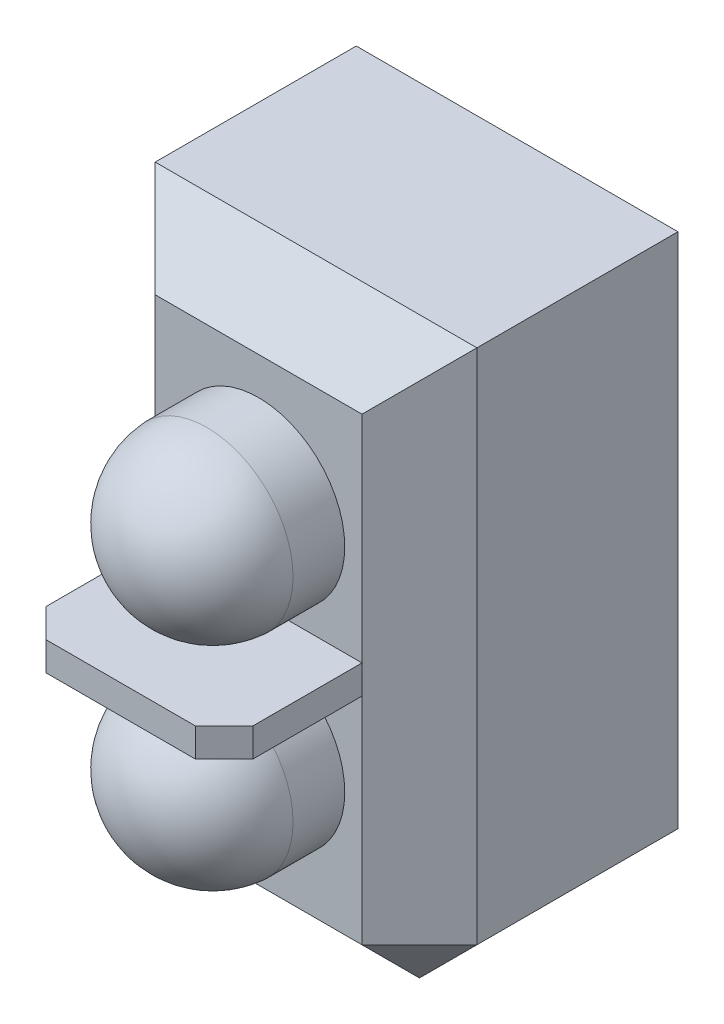
ISO-10303-21;
HEADER;
FILE_DESCRIPTION(('STEP AP214'),'2;1');
FILE_NAME('part.step','',(''),(''),'','','');
FILE_SCHEMA(('AUTOMOTIVE_DESIGN { 1 0 10303 214 1 1 1 1 }'));
ENDSEC;
DATA;
#1=APPLICATION_CONTEXT('core data for automotive mechanical design processes');
#2=APPLICATION_PROTOCOL_DEFINITION('international standard','automotive_design',2000,#1);
#3=PRODUCT_CONTEXT('',#1,'mechanical');
#4=PRODUCT('Part','Part','',(#3));
#5=PRODUCT_RELATED_PRODUCT_CATEGORY('part','',(#4));
#6=PRODUCT_DEFINITION_FORMATION('','',#4);
#7=PRODUCT_DEFINITION_CONTEXT('part definition',#1,'design');
#8=PRODUCT_DEFINITION('design','',#6,#7);
#9=PRODUCT_DEFINITION_SHAPE('','',#8);
#10=(LENGTH_UNIT() NAMED_UNIT(*) SI_UNIT(.MILLI.,.METRE.));
#11=(NAMED_UNIT(*) PLANE_ANGLE_UNIT() SI_UNIT($,.RADIAN.));
#12=(NAMED_UNIT(*) SI_UNIT($,.STERADIAN.) SOLID_ANGLE_UNIT());
#13=UNCERTAINTY_MEASURE_WITH_UNIT(LENGTH_MEASURE(1.E-05),#10,'distance_accuracy_value','');
#14=(GEOMETRIC_REPRESENTATION_CONTEXT(3) GLOBAL_UNCERTAINTY_ASSIGNED_CONTEXT((#13)) GLOBAL_UNIT_ASSIGNED_CONTEXT((#10,
#11,#12)) REPRESENTATION_CONTEXT('',''));
#15=CARTESIAN_POINT('',(0.,0.,0.));
#16=DIRECTION('',(0.,0.,1.));
#17=DIRECTION('',(1.,0.,0.));
#18=AXIS2_PLACEMENT_3D('',#15,#16,#17);
#19=CARTESIAN_POINT('',(2.8,-5.,4.5));
#20=DIRECTION('',(0.,0.,1.));
#21=DIRECTION('',(1.,0.,0.));
#22=AXIS2_PLACEMENT_3D('',#19,#20,#21);
#23=PLANE('',#22);
#24=CARTESIAN_POINT('',(0.,1.85,4.5));
#25=DIRECTION('',(0.,0.,1.));
#26=DIRECTION('',(1.,0.,0.));
#27=AXIS2_PLACEMENT_3D('',#24,#25,#26);
#28=CIRCLE('',#27,1.5);
#29=CARTESIAN_POINT('',(1.5,1.85,4.5));
#30=VERTEX_POINT('',#29);
#31=EDGE_CURVE('E185',#30,#30,#28,.T.);
#32=ORIENTED_EDGE('',*,*,#31,.F.);
#33=EDGE_LOOP('',(#32));
#34=FACE_BOUND('',#33,.T.);
#35=DIRECTION('',(0.,-1.,0.));
#36=VECTOR('',#35,1.);
#37=CARTESIAN_POINT('',(-1.79999999999999,-5.,4.5));
#38=LINE('',#37,#36);
#39=CARTESIAN_POINT('',(-1.8,4.,4.5));
#40=VERTEX_POINT('',#39);
#41=CARTESIAN_POINT('',(-1.8,0.25,4.5));
#42=VERTEX_POINT('',#41);
#43=EDGE_CURVE('E161',#40,#42,#38,.T.);
#44=ORIENTED_EDGE('',*,*,#43,.T.);
#45=DIRECTION('',(-1.,0.,0.));
#46=VECTOR('',#45,1.);
#47=CARTESIAN_POINT('',(-1.8,0.25,4.5));
#48=LINE('',#47,#46);
#49=CARTESIAN_POINT('',(1.8,0.25,4.5));
#50=VERTEX_POINT('',#49);
#51=EDGE_CURVE('E136',#50,#42,#48,.T.);
#52=ORIENTED_EDGE('',*,*,#51,.F.);
#53=DIRECTION('',(0.,1.,0.));
#54=VECTOR('',#53,1.);
#55=CARTESIAN_POINT('',(1.8,5.,4.5));
#56=LINE('',#55,#54);
#57=CARTESIAN_POINT('',(1.8,4.,4.5));
#58=VERTEX_POINT('',#57);
#59=EDGE_CURVE('E146',#50,#58,#56,.T.);
#60=ORIENTED_EDGE('',*,*,#59,.T.);
#61=DIRECTION('',(-1.,0.,0.));
#62=VECTOR('',#61,1.);
#63=CARTESIAN_POINT('',(-2.8,4.,4.5));
#64=LINE('',#63,#62);
#65=EDGE_CURVE('E227',#58,#40,#64,.T.);
#66=ORIENTED_EDGE('',*,*,#65,.T.);
#67=EDGE_LOOP('',(#44,#52,#60,#66));
#68=FACE_BOUND('',#67,.T.);
#69=ADVANCED_FACE('F33',(#34,#68),#23,.T.);
#70=CARTESIAN_POINT('',(0.,-1.85,4.5));
#71=DIRECTION('',(0.,0.,1.));
#72=DIRECTION('',(1.,0.,0.));
#73=AXIS2_PLACEMENT_3D('',#70,#71,#72);
#74=CIRCLE('',#73,1.5);
#75=CARTESIAN_POINT('',(1.5,-1.85,4.5));
#76=VERTEX_POINT('',#75);
#77=EDGE_CURVE('E140',#76,#76,#74,.T.);
#78=ORIENTED_EDGE('',*,*,#77,.F.);
#79=EDGE_LOOP('',(#78));
#80=FACE_BOUND('',#79,.T.);
#81=CARTESIAN_POINT('',(1.8,-3.99999999999999,4.5));
#82=VERTEX_POINT('',#81);
#83=CARTESIAN_POINT('',(1.8,-0.25,4.5));
#84=VERTEX_POINT('',#83);
#85=EDGE_CURVE('E156',#82,#84,#56,.T.);
#86=ORIENTED_EDGE('',*,*,#85,.T.);
#87=DIRECTION('',(1.,0.,0.));
#88=VECTOR('',#87,1.);
#89=CARTESIAN_POINT('',(-1.8,-0.25,4.5));
#90=LINE('',#89,#88);
#91=CARTESIAN_POINT('',(-1.8,-0.25,4.5));
#92=VERTEX_POINT('',#91);
#93=EDGE_CURVE('E174',#92,#84,#90,.T.);
#94=ORIENTED_EDGE('',*,*,#93,.F.);
#95=CARTESIAN_POINT('',(-1.79999999999999,-3.99999999999999,4.5));
#96=VERTEX_POINT('',#95);
#97=EDGE_CURVE('E225',#92,#96,#38,.T.);
#98=ORIENTED_EDGE('',*,*,#97,.T.);
#99=DIRECTION('',(1.,0.,0.));
#100=VECTOR('',#99,1.);
#101=CARTESIAN_POINT('',(2.8,-3.99999999999999,4.5));
#102=LINE('',#101,#100);
#103=EDGE_CURVE('E157',#96,#82,#102,.T.);
#104=ORIENTED_EDGE('',*,*,#103,.T.);
#105=EDGE_LOOP('',(#86,#94,#98,#104));
#106=FACE_BOUND('',#105,.T.);
#107=ADVANCED_FACE('F291',(#80,#106),#23,.T.);
#108=CARTESIAN_POINT('',(2.8,5.,4.5));
#109=DIRECTION('',(-1.,0.,0.));
#110=DIRECTION('',(0.,0.,1.));
#111=AXIS2_PLACEMENT_3D('',#108,#109,#110);
#112=PLANE('',#111);
#113=DIRECTION('',(0.,-1.,0.));
#114=VECTOR('',#113,1.);
#115=CARTESIAN_POINT('',(2.8,-5.,3.5));
#116=LINE('',#115,#114);
#117=CARTESIAN_POINT('',(2.8,5.,3.5));
#118=VERTEX_POINT('',#117);
#119=CARTESIAN_POINT('',(2.8,-3.99999999999999,3.5));
#120=VERTEX_POINT('',#119);
#121=EDGE_CURVE('E206',#118,#120,#116,.T.);
#122=ORIENTED_EDGE('',*,*,#121,.T.);
#123=DIRECTION('',(0.,0.,-1.));
#124=VECTOR('',#123,1.);
#125=CARTESIAN_POINT('',(2.8,-3.99999999999999,4.5));
#126=LINE('',#125,#124);
#127=CARTESIAN_POINT('',(2.8,-3.99999999999999,0.));
#128=VERTEX_POINT('',#127);
#129=EDGE_CURVE('E208',#120,#128,#126,.T.);
#130=ORIENTED_EDGE('',*,*,#129,.T.);
#131=DIRECTION('',(0.,1.,0.));
#132=VECTOR('',#131,1.);
#133=CARTESIAN_POINT('',(2.8,5.,0.));
#134=LINE('',#133,#132);
#135=CARTESIAN_POINT('',(2.8,5.,0.));
#136=VERTEX_POINT('',#135);
#137=EDGE_CURVE('E189',#128,#136,#134,.T.);
#138=ORIENTED_EDGE('',*,*,#137,.T.);
#139=DIRECTION('',(0.,0.,-1.));
#140=VECTOR('',#139,1.);
#141=CARTESIAN_POINT('',(2.8,5.,4.5));
#142=LINE('',#141,#140);
#143=EDGE_CURVE('E204',#118,#136,#142,.T.);
#144=ORIENTED_EDGE('',*,*,#143,.F.);
#145=EDGE_LOOP('',(#122,#130,#138,#144));
#146=FACE_BOUND('',#145,.T.);
#147=ADVANCED_FACE('F305',(#146),#112,.F.);
#148=CARTESIAN_POINT('',(-2.8,5.,4.5));
#149=DIRECTION('',(0.,-1.,0.));
#150=DIRECTION('',(0.,0.,-1.));
#151=AXIS2_PLACEMENT_3D('',#148,#149,#150);
#152=PLANE('',#151);
#153=DIRECTION('',(0.,0.,-1.));
#154=VECTOR('',#153,1.);
#155=CARTESIAN_POINT('',(-2.8,5.,4.5));
#156=LINE('',#155,#154);
#157=CARTESIAN_POINT('',(-2.8,5.,3.5));
#158=VERTEX_POINT('',#157);
#159=CARTESIAN_POINT('',(-2.8,5.,0.));
#160=VERTEX_POINT('',#159);
#161=EDGE_CURVE('E202',#158,#160,#156,.T.);
#162=ORIENTED_EDGE('',*,*,#161,.F.);
#163=DIRECTION('',(1.,0.,0.));
#164=VECTOR('',#163,1.);
#165=CARTESIAN_POINT('',(2.8,5.,3.5));
#166=LINE('',#165,#164);
#167=EDGE_CURVE('E230',#158,#118,#166,.T.);
#168=ORIENTED_EDGE('',*,*,#167,.T.);
#169=ORIENTED_EDGE('',*,*,#143,.T.);
#170=DIRECTION('',(-1.,0.,0.));
#171=VECTOR('',#170,1.);
#172=CARTESIAN_POINT('',(-2.8,5.,0.));
#173=LINE('',#172,#171);
#174=EDGE_CURVE('E192',#136,#160,#173,.T.);
#175=ORIENTED_EDGE('',*,*,#174,.T.);
#176=EDGE_LOOP('',(#162,#168,#169,#175));
#177=FACE_BOUND('',#176,.T.);
#178=ADVANCED_FACE('F324',(#177),#152,.F.);
#179=CARTESIAN_POINT('',(-2.8,5.,4.5));
#180=DIRECTION('',(1.,0.,0.));
#181=DIRECTION('',(0.,1.,0.));
#182=AXIS2_PLACEMENT_3D('',#179,#180,#181);
#183=PLANE('',#182);
#184=DIRECTION('',(0.,-1.,0.));
#185=VECTOR('',#184,1.);
#186=CARTESIAN_POINT('',(-2.8,5.,0.));
#187=LINE('',#186,#185);
#188=CARTESIAN_POINT('',(-2.8,-4.,0.));
#189=VERTEX_POINT('',#188);
#190=EDGE_CURVE('E196',#160,#189,#187,.T.);
#191=ORIENTED_EDGE('',*,*,#190,.T.);
#192=DIRECTION('',(0.,0.,1.));
#193=VECTOR('',#192,1.);
#194=CARTESIAN_POINT('',(-2.8,-4.,4.5));
#195=LINE('',#194,#193);
#196=CARTESIAN_POINT('',(-2.8,-4.,3.5));
#197=VERTEX_POINT('',#196);
#198=EDGE_CURVE('E223',#189,#197,#195,.T.);
#199=ORIENTED_EDGE('',*,*,#198,.T.);
#200=DIRECTION('',(0.,1.,0.));
#201=VECTOR('',#200,1.);
#202=CARTESIAN_POINT('',(-2.8,5.,3.5));
#203=LINE('',#202,#201);
#204=EDGE_CURVE('E221',#197,#158,#203,.T.);
#205=ORIENTED_EDGE('',*,*,#204,.T.);
#206=ORIENTED_EDGE('',*,*,#161,.T.);
#207=EDGE_LOOP('',(#191,#199,#205,#206));
#208=FACE_BOUND('',#207,.T.);
#209=ADVANCED_FACE('F320',(#208),#183,.F.);
#210=CARTESIAN_POINT('',(-2.8,-5.,4.5));
#211=DIRECTION('',(0.,1.,0.));
#212=DIRECTION('',(0.,0.,1.));
#213=AXIS2_PLACEMENT_3D('',#210,#211,#212);
#214=PLANE('',#213);
#215=DIRECTION('',(1.,0.,0.));
#216=VECTOR('',#215,1.);
#217=CARTESIAN_POINT('',(-2.8,-5.,0.));
#218=LINE('',#217,#216);
#219=CARTESIAN_POINT('',(-1.79999999999999,-5.,0.));
#220=VERTEX_POINT('',#219);
#221=CARTESIAN_POINT('',(1.8,-5.,0.));
#222=VERTEX_POINT('',#221);
#223=EDGE_CURVE('E199',#220,#222,#218,.T.);
#224=ORIENTED_EDGE('',*,*,#223,.T.);
#225=DIRECTION('',(0.,0.,1.));
#226=VECTOR('',#225,1.);
#227=CARTESIAN_POINT('',(1.8,-5.,4.5));
#228=LINE('',#227,#226);
#229=CARTESIAN_POINT('',(1.8,-5.,3.5));
#230=VERTEX_POINT('',#229);
#231=EDGE_CURVE('E219',#222,#230,#228,.T.);
#232=ORIENTED_EDGE('',*,*,#231,.T.);
#233=DIRECTION('',(-1.,0.,0.));
#234=VECTOR('',#233,1.);
#235=CARTESIAN_POINT('',(-2.8,-5.,3.5));
#236=LINE('',#235,#234);
#237=CARTESIAN_POINT('',(-1.79999999999999,-5.,3.5));
#238=VERTEX_POINT('',#237);
#239=EDGE_CURVE('E215',#230,#238,#236,.T.);
#240=ORIENTED_EDGE('',*,*,#239,.T.);
#241=DIRECTION('',(0.,0.,-1.));
#242=VECTOR('',#241,1.);
#243=CARTESIAN_POINT('',(-1.79999999999999,-5.,4.5));
#244=LINE('',#243,#242);
#245=EDGE_CURVE('E217',#238,#220,#244,.T.);
#246=ORIENTED_EDGE('',*,*,#245,.T.);
#247=EDGE_LOOP('',(#224,#232,#240,#246));
#248=FACE_BOUND('',#247,.T.);
#249=ADVANCED_FACE('F316',(#248),#214,.F.);
#250=CARTESIAN_POINT('',(2.8,-5.,0.));
#251=DIRECTION('',(0.,0.,1.));
#252=DIRECTION('',(1.,0.,0.));
#253=AXIS2_PLACEMENT_3D('',#250,#251,#252);
#254=PLANE('',#253);
#255=ORIENTED_EDGE('',*,*,#137,.F.);
#256=DIRECTION('',(0.707106781186546,0.707106781186549,0.));
#257=VECTOR('',#256,1.);
#258=CARTESIAN_POINT('',(2.8,-3.99999999999999,0.));
#259=LINE('',#258,#257);
#260=EDGE_CURVE('E213',#128,#222,#259,.F.);
#261=ORIENTED_EDGE('',*,*,#260,.T.);
#262=ORIENTED_EDGE('',*,*,#223,.F.);
#263=DIRECTION('',(0.707106781186549,-0.707106781186546,0.));
#264=VECTOR('',#263,1.);
#265=CARTESIAN_POINT('',(-1.79999999999999,-5.,0.));
#266=LINE('',#265,#264);
#267=EDGE_CURVE('E211',#220,#189,#266,.F.);
#268=ORIENTED_EDGE('',*,*,#267,.T.);
#269=ORIENTED_EDGE('',*,*,#190,.F.);
#270=ORIENTED_EDGE('',*,*,#174,.F.);
#271=EDGE_LOOP('',(#255,#261,#262,#268,#269,#270));
#272=FACE_BOUND('',#271,.T.);
#273=ADVANCED_FACE('F312',(#272),#254,.F.);
#274=CARTESIAN_POINT('',(-1.79999999999999,-5.,4.5));
#275=DIRECTION('',(0.707106781186546,0.707106781186549,0.));
#276=DIRECTION('',(-0.707106781186549,0.707106781186546,0.));
#277=AXIS2_PLACEMENT_3D('',#274,#275,#276);
#278=PLANE('',#277);
#279=ORIENTED_EDGE('',*,*,#267,.F.);
#280=ORIENTED_EDGE('',*,*,#245,.F.);
#281=DIRECTION('',(-0.707106781186549,0.707106781186546,0.));
#282=VECTOR('',#281,1.);
#283=CARTESIAN_POINT('',(-2.8,-4.,3.5));
#284=LINE('',#283,#282);
#285=EDGE_CURVE('E193',#197,#238,#284,.F.);
#286=ORIENTED_EDGE('',*,*,#285,.F.);
#287=ORIENTED_EDGE('',*,*,#198,.F.);
#288=EDGE_LOOP('',(#279,#280,#286,#287));
#289=FACE_BOUND('',#288,.T.);
#290=ADVANCED_FACE('F315',(#289),#278,.F.);
#291=CARTESIAN_POINT('',(-1.79999999999999,-5.,4.5));
#292=DIRECTION('',(-0.707106781186546,0.,0.707106781186549));
#293=DIRECTION('',(0.707106781186549,0.,0.707106781186546));
#294=AXIS2_PLACEMENT_3D('',#291,#292,#293);
#295=PLANE('',#294);
#296=DIRECTION('',(-0.577350269189627,0.577350269189627,-0.577350269189624));
#297=VECTOR('',#296,1.);
#298=CARTESIAN_POINT('',(1.20000000000001,0.999999999999988,7.49999999999999));
#299=LINE('',#298,#297);
#300=EDGE_CURVE('E246',#158,#40,#299,.F.);
#301=ORIENTED_EDGE('',*,*,#300,.F.);
#302=ORIENTED_EDGE('',*,*,#204,.F.);
#303=DIRECTION('',(-0.707106781186549,0.,-0.707106781186546));
#304=VECTOR('',#303,1.);
#305=CARTESIAN_POINT('',(-2.8,-4.,3.5));
#306=LINE('',#305,#304);
#307=EDGE_CURVE('E249',#96,#197,#306,.T.);
#308=ORIENTED_EDGE('',*,*,#307,.F.);
#309=ORIENTED_EDGE('',*,*,#97,.F.);
#310=DIRECTION('',(0.,-1.,0.));
#311=VECTOR('',#310,1.);
#312=CARTESIAN_POINT('',(-1.8,-0.25,4.5));
#313=LINE('',#312,#311);
#314=EDGE_CURVE('E162',#42,#92,#313,.T.);
#315=ORIENTED_EDGE('',*,*,#314,.F.);
#316=ORIENTED_EDGE('',*,*,#43,.F.);
#317=EDGE_LOOP('',(#301,#302,#308,#309,#315,#316));
#318=FACE_BOUND('',#317,.T.);
#319=ADVANCED_FACE('F286',(#318),#295,.T.);
#320=CARTESIAN_POINT('',(-2.8,-4.,3.5));
#321=DIRECTION('',(-0.577350269189623,-0.577350269189626,0.577350269189629));
#322=DIRECTION('',(0.,-0.707106781186549,-0.707106781186546));
#323=AXIS2_PLACEMENT_3D('',#320,#321,#322);
#324=PLANE('',#323);
#325=ORIENTED_EDGE('',*,*,#307,.T.);
#326=ORIENTED_EDGE('',*,*,#285,.T.);
#327=DIRECTION('',(0.,0.707106781186549,0.707106781186546));
#328=VECTOR('',#327,1.);
#329=CARTESIAN_POINT('',(-1.79999999999999,-4.5,4.));
#330=LINE('',#329,#328);
#331=EDGE_CURVE('E243',#96,#238,#330,.F.);
#332=ORIENTED_EDGE('',*,*,#331,.F.);
#333=EDGE_LOOP('',(#325,#326,#332));
#334=FACE_BOUND('',#333,.T.);
#335=ADVANCED_FACE('F349',(#334),#324,.T.);
#336=CARTESIAN_POINT('',(2.8,4.,4.5));
#337=DIRECTION('',(0.,0.707106781186546,0.707106781186549));
#338=DIRECTION('',(0.,-0.707106781186549,0.707106781186546));
#339=AXIS2_PLACEMENT_3D('',#336,#337,#338);
#340=PLANE('',#339);
#341=ORIENTED_EDGE('',*,*,#300,.T.);
#342=ORIENTED_EDGE('',*,*,#65,.F.);
#343=DIRECTION('',(0.577350269189627,0.577350269189627,-0.577350269189624));
#344=VECTOR('',#343,1.);
#345=CARTESIAN_POINT('',(2.13333333333333,4.33333333333333,4.16666666666667));
#346=LINE('',#345,#344);
#347=EDGE_CURVE('E153',#118,#58,#346,.F.);
#348=ORIENTED_EDGE('',*,*,#347,.F.);
#349=ORIENTED_EDGE('',*,*,#167,.F.);
#350=EDGE_LOOP('',(#341,#342,#348,#349));
#351=FACE_BOUND('',#350,.T.);
#352=ADVANCED_FACE('F345',(#351),#340,.T.);
#353=CARTESIAN_POINT('',(2.8,-3.99999999999999,4.5));
#354=DIRECTION('',(0.,-0.707106781186546,0.707106781186549));
#355=DIRECTION('',(0.,-0.707106781186549,-0.707106781186546));
#356=AXIS2_PLACEMENT_3D('',#353,#354,#355);
#357=PLANE('',#356);
#358=ORIENTED_EDGE('',*,*,#331,.T.);
#359=ORIENTED_EDGE('',*,*,#239,.F.);
#360=DIRECTION('',(0.,-0.707106781186549,-0.707106781186546));
#361=VECTOR('',#360,1.);
#362=CARTESIAN_POINT('',(1.8,-5.,3.5));
#363=LINE('',#362,#361);
#364=EDGE_CURVE('E239',#82,#230,#363,.T.);
#365=ORIENTED_EDGE('',*,*,#364,.F.);
#366=ORIENTED_EDGE('',*,*,#103,.F.);
#367=EDGE_LOOP('',(#358,#359,#365,#366));
#368=FACE_BOUND('',#367,.T.);
#369=ADVANCED_FACE('F342',(#368),#357,.T.);
#370=CARTESIAN_POINT('',(1.8,-5.,4.5));
#371=DIRECTION('',(0.707106781186546,0.,0.707106781186549));
#372=DIRECTION('',(0.707106781186549,0.,-0.707106781186546));
#373=AXIS2_PLACEMENT_3D('',#370,#371,#372);
#374=PLANE('',#373);
#375=ORIENTED_EDGE('',*,*,#347,.T.);
#376=ORIENTED_EDGE('',*,*,#59,.F.);
#377=DIRECTION('',(0.,1.,0.));
#378=VECTOR('',#377,1.);
#379=CARTESIAN_POINT('',(1.8,-0.25,4.5));
#380=LINE('',#379,#378);
#381=EDGE_CURVE('E149',#84,#50,#380,.T.);
#382=ORIENTED_EDGE('',*,*,#381,.F.);
#383=ORIENTED_EDGE('',*,*,#85,.F.);
#384=DIRECTION('',(-0.707106781186549,0.,0.707106781186546));
#385=VECTOR('',#384,1.);
#386=CARTESIAN_POINT('',(2.3,-3.99999999999999,4.));
#387=LINE('',#386,#385);
#388=EDGE_CURVE('E236',#120,#82,#387,.T.);
#389=ORIENTED_EDGE('',*,*,#388,.F.);
#390=ORIENTED_EDGE('',*,*,#121,.F.);
#391=EDGE_LOOP('',(#375,#376,#382,#383,#389,#390));
#392=FACE_BOUND('',#391,.T.);
#393=ADVANCED_FACE('F147',(#392),#374,.T.);
#394=CARTESIAN_POINT('',(1.8,-5.,3.5));
#395=DIRECTION('',(0.577350269189626,-0.577350269189623,0.577350269189629));
#396=DIRECTION('',(0.707106781186549,0.,-0.707106781186546));
#397=AXIS2_PLACEMENT_3D('',#394,#395,#396);
#398=PLANE('',#397);
#399=ORIENTED_EDGE('',*,*,#388,.T.);
#400=ORIENTED_EDGE('',*,*,#364,.T.);
#401=DIRECTION('',(-0.707106781186546,-0.707106781186549,0.));
#402=VECTOR('',#401,1.);
#403=CARTESIAN_POINT('',(1.8,-5.,3.5));
#404=LINE('',#403,#402);
#405=EDGE_CURVE('E233',#120,#230,#404,.T.);
#406=ORIENTED_EDGE('',*,*,#405,.F.);
#407=EDGE_LOOP('',(#399,#400,#406));
#408=FACE_BOUND('',#407,.T.);
#409=ADVANCED_FACE('F335',(#408),#398,.T.);
#410=CARTESIAN_POINT('',(2.8,-3.99999999999999,4.5));
#411=DIRECTION('',(-0.707106781186549,0.707106781186546,0.));
#412=DIRECTION('',(-0.707106781186546,-0.707106781186549,0.));
#413=AXIS2_PLACEMENT_3D('',#410,#411,#412);
#414=PLANE('',#413);
#415=ORIENTED_EDGE('',*,*,#405,.T.);
#416=ORIENTED_EDGE('',*,*,#231,.F.);
#417=ORIENTED_EDGE('',*,*,#260,.F.);
#418=ORIENTED_EDGE('',*,*,#129,.F.);
#419=EDGE_LOOP('',(#415,#416,#417,#418));
#420=FACE_BOUND('',#419,.T.);
#421=ADVANCED_FACE('F332',(#420),#414,.F.);
#422=CARTESIAN_POINT('',(0.,1.85,5.4));
#423=DIRECTION('',(0.,0.,-1.));
#424=DIRECTION('',(-1.,0.,0.));
#425=AXIS2_PLACEMENT_3D('',#422,#423,#424);
#426=CYLINDRICAL_SURFACE('',#425,1.5);
#427=CARTESIAN_POINT('',(0.,1.85,5.4));
#428=DIRECTION('',(0.,0.,1.));
#429=DIRECTION('',(1.,0.,0.));
#430=AXIS2_PLACEMENT_3D('',#427,#428,#429);
#431=CIRCLE('',#430,1.5);
#432=CARTESIAN_POINT('',(1.5,1.85,5.4));
#433=VERTEX_POINT('',#432);
#434=EDGE_CURVE('E188',#433,#433,#431,.T.);
#435=ORIENTED_EDGE('',*,*,#434,.F.);
#436=EDGE_LOOP('',(#435));
#437=FACE_BOUND('',#436,.T.);
#438=ORIENTED_EDGE('',*,*,#31,.T.);
#439=EDGE_LOOP('',(#438));
#440=FACE_BOUND('',#439,.T.);
#441=ADVANCED_FACE('F310',(#437,#440),#426,.T.);
#442=CARTESIAN_POINT('',(0.,1.85,5.29642857142857));
#443=DIRECTION('',(0.,0.,1.));
#444=DIRECTION('',(1.,0.,0.));
#445=AXIS2_PLACEMENT_3D('',#442,#443,#444);
#446=SPHERICAL_SURFACE('',#445,1.50357142857143);
#447=ORIENTED_EDGE('',*,*,#434,.T.);
#448=EDGE_LOOP('',(#447));
#449=FACE_BOUND('',#448,.T.);
#450=ADVANCED_FACE('F359',(#449),#446,.T.);
#451=CARTESIAN_POINT('',(0.,-1.85,5.4));
#452=DIRECTION('',(0.,0.,-1.));
#453=DIRECTION('',(-1.,0.,0.));
#454=AXIS2_PLACEMENT_3D('',#451,#452,#453);
#455=CYLINDRICAL_SURFACE('',#454,1.5);
#456=CARTESIAN_POINT('',(0.,-1.85,5.4));
#457=DIRECTION('',(0.,0.,1.));
#458=DIRECTION('',(1.,0.,0.));
#459=AXIS2_PLACEMENT_3D('',#456,#457,#458);
#460=CIRCLE('',#459,1.5);
#461=CARTESIAN_POINT('',(1.5,-1.85,5.4));
#462=VERTEX_POINT('',#461);
#463=EDGE_CURVE('E184',#462,#462,#460,.T.);
#464=ORIENTED_EDGE('',*,*,#463,.F.);
#465=EDGE_LOOP('',(#464));
#466=FACE_BOUND('',#465,.T.);
#467=ORIENTED_EDGE('',*,*,#77,.T.);
#468=EDGE_LOOP('',(#467));
#469=FACE_BOUND('',#468,.T.);
#470=ADVANCED_FACE('F362',(#466,#469),#455,.T.);
#471=CARTESIAN_POINT('',(0.,-1.85,5.29642857142857));
#472=DIRECTION('',(0.,0.,1.));
#473=DIRECTION('',(1.,0.,0.));
#474=AXIS2_PLACEMENT_3D('',#471,#472,#473);
#475=SPHERICAL_SURFACE('',#474,1.50357142857143);
#476=ORIENTED_EDGE('',*,*,#463,.T.);
#477=EDGE_LOOP('',(#476));
#478=FACE_BOUND('',#477,.T.);
#479=ADVANCED_FACE('F364',(#478),#475,.T.);
#480=CARTESIAN_POINT('',(1.8,-0.25,6.9));
#481=DIRECTION('',(-1.,0.,0.));
#482=DIRECTION('',(0.,0.,1.));
#483=AXIS2_PLACEMENT_3D('',#480,#481,#482);
#484=PLANE('',#483);
#485=DIRECTION('',(0.,0.,-1.));
#486=VECTOR('',#485,1.);
#487=CARTESIAN_POINT('',(1.8,0.25,6.9));
#488=LINE('',#487,#486);
#489=CARTESIAN_POINT('',(1.8,0.25,6.4));
#490=VERTEX_POINT('',#489);
#491=EDGE_CURVE('E132',#490,#50,#488,.T.);
#492=ORIENTED_EDGE('',*,*,#491,.F.);
#493=DIRECTION('',(0.,-1.,0.));
#494=VECTOR('',#493,1.);
#495=CARTESIAN_POINT('',(1.8,-0.25,6.4));
#496=LINE('',#495,#494);
#497=CARTESIAN_POINT('',(1.8,-0.25,6.4));
#498=VERTEX_POINT('',#497);
#499=EDGE_CURVE('E11',#490,#498,#496,.T.);
#500=ORIENTED_EDGE('',*,*,#499,.T.);
#501=DIRECTION('',(0.,0.,-1.));
#502=VECTOR('',#501,1.);
#503=CARTESIAN_POINT('',(1.8,-0.25,6.9));
#504=LINE('',#503,#502);
#505=EDGE_CURVE('E166',#498,#84,#504,.T.);
#506=ORIENTED_EDGE('',*,*,#505,.T.);
#507=ORIENTED_EDGE('',*,*,#381,.T.);
#508=EDGE_LOOP('',(#492,#500,#506,#507));
#509=FACE_BOUND('',#508,.T.);
#510=ADVANCED_FACE('F164',(#509),#484,.F.);
#511=CARTESIAN_POINT('',(-1.8,0.25,6.9));
#512=DIRECTION('',(0.,-1.,0.));
#513=DIRECTION('',(0.,0.,-1.));
#514=AXIS2_PLACEMENT_3D('',#511,#512,#513);
#515=PLANE('',#514);
#516=DIRECTION('',(0.,0.,-1.));
#517=VECTOR('',#516,1.);
#518=CARTESIAN_POINT('',(-1.8,0.25,6.9));
#519=LINE('',#518,#517);
#520=CARTESIAN_POINT('',(-1.8,0.25,6.4));
#521=VERTEX_POINT('',#520);
#522=EDGE_CURVE('E141',#521,#42,#519,.T.);
#523=ORIENTED_EDGE('',*,*,#522,.F.);
#524=DIRECTION('',(-0.707106781186546,0.,-0.707106781186549));
#525=VECTOR('',#524,1.);
#526=CARTESIAN_POINT('',(-1.3,0.25,6.9));
#527=LINE('',#526,#525);
#528=CARTESIAN_POINT('',(-1.3,0.25,6.9));
#529=VERTEX_POINT('',#528);
#530=EDGE_CURVE('E41',#521,#529,#527,.F.);
#531=ORIENTED_EDGE('',*,*,#530,.T.);
#532=DIRECTION('',(-1.,0.,0.));
#533=VECTOR('',#532,1.);
#534=CARTESIAN_POINT('',(-1.8,0.25,6.9));
#535=LINE('',#534,#533);
#536=CARTESIAN_POINT('',(1.29999999999999,0.25,6.9));
#537=VERTEX_POINT('',#536);
#538=EDGE_CURVE('E177',#537,#529,#535,.T.);
#539=ORIENTED_EDGE('',*,*,#538,.F.);
#540=DIRECTION('',(-0.707106781186546,0.,0.707106781186549));
#541=VECTOR('',#540,1.);
#542=CARTESIAN_POINT('',(1.29999999999999,0.25,6.9));
#543=LINE('',#542,#541);
#544=EDGE_CURVE('E48',#537,#490,#543,.F.);
#545=ORIENTED_EDGE('',*,*,#544,.T.);
#546=ORIENTED_EDGE('',*,*,#491,.T.);
#547=ORIENTED_EDGE('',*,*,#51,.T.);
#548=EDGE_LOOP('',(#523,#531,#539,#545,#546,#547));
#549=FACE_BOUND('',#548,.T.);
#550=ADVANCED_FACE('F134',(#549),#515,.F.);
#551=CARTESIAN_POINT('',(-1.8,-0.25,6.9));
#552=DIRECTION('',(1.,0.,0.));
#553=DIRECTION('',(0.,0.,-1.));
#554=AXIS2_PLACEMENT_3D('',#551,#552,#553);
#555=PLANE('',#554);
#556=DIRECTION('',(0.,0.,-1.));
#557=VECTOR('',#556,1.);
#558=CARTESIAN_POINT('',(-1.8,-0.25,6.9));
#559=LINE('',#558,#557);
#560=CARTESIAN_POINT('',(-1.8,-0.25,6.4));
#561=VERTEX_POINT('',#560);
#562=EDGE_CURVE('E179',#561,#92,#559,.T.);
#563=ORIENTED_EDGE('',*,*,#562,.F.);
#564=DIRECTION('',(0.,1.,0.));
#565=VECTOR('',#564,1.);
#566=CARTESIAN_POINT('',(-1.8,-0.25,6.4));
#567=LINE('',#566,#565);
#568=EDGE_CURVE('E56',#561,#521,#567,.T.);
#569=ORIENTED_EDGE('',*,*,#568,.T.);
#570=ORIENTED_EDGE('',*,*,#522,.T.);
#571=ORIENTED_EDGE('',*,*,#314,.T.);
#572=EDGE_LOOP('',(#563,#569,#570,#571));
#573=FACE_BOUND('',#572,.T.);
#574=ADVANCED_FACE('F281',(#573),#555,.F.);
#575=CARTESIAN_POINT('',(-1.8,-0.25,6.9));
#576=DIRECTION('',(0.,1.,0.));
#577=DIRECTION('',(0.,0.,1.));
#578=AXIS2_PLACEMENT_3D('',#575,#576,#577);
#579=PLANE('',#578);
#580=DIRECTION('',(1.,0.,0.));
#581=VECTOR('',#580,1.);
#582=CARTESIAN_POINT('',(-1.8,-0.25,6.9));
#583=LINE('',#582,#581);
#584=CARTESIAN_POINT('',(-1.3,-0.25,6.9));
#585=VERTEX_POINT('',#584);
#586=CARTESIAN_POINT('',(1.29999999999999,-0.25,6.9));
#587=VERTEX_POINT('',#586);
#588=EDGE_CURVE('E169',#585,#587,#583,.T.);
#589=ORIENTED_EDGE('',*,*,#588,.F.);
#590=DIRECTION('',(0.707106781186546,0.,0.707106781186549));
#591=VECTOR('',#590,1.);
#592=CARTESIAN_POINT('',(-1.3,-0.25,6.9));
#593=LINE('',#592,#591);
#594=EDGE_CURVE('E265',#585,#561,#593,.F.);
#595=ORIENTED_EDGE('',*,*,#594,.T.);
#596=ORIENTED_EDGE('',*,*,#562,.T.);
#597=ORIENTED_EDGE('',*,*,#93,.T.);
#598=ORIENTED_EDGE('',*,*,#505,.F.);
#599=DIRECTION('',(0.707106781186546,0.,-0.707106781186549));
#600=VECTOR('',#599,1.);
#601=CARTESIAN_POINT('',(1.29999999999999,-0.25,6.9));
#602=LINE('',#601,#600);
#603=EDGE_CURVE('E263',#498,#587,#602,.F.);
#604=ORIENTED_EDGE('',*,*,#603,.T.);
#605=EDGE_LOOP('',(#589,#595,#596,#597,#598,#604));
#606=FACE_BOUND('',#605,.T.);
#607=ADVANCED_FACE('F279',(#606),#579,.F.);
#608=CARTESIAN_POINT('',(1.8,0.25,6.9));
#609=DIRECTION('',(0.,0.,-1.));
#610=DIRECTION('',(-1.,0.,0.));
#611=AXIS2_PLACEMENT_3D('',#608,#609,#610);
#612=PLANE('',#611);
#613=ORIENTED_EDGE('',*,*,#538,.T.);
#614=DIRECTION('',(0.,-1.,0.));
#615=VECTOR('',#614,1.);
#616=CARTESIAN_POINT('',(-1.3,0.25,6.9));
#617=LINE('',#616,#615);
#618=EDGE_CURVE('E260',#529,#585,#617,.T.);
#619=ORIENTED_EDGE('',*,*,#618,.T.);
#620=ORIENTED_EDGE('',*,*,#588,.T.);
#621=DIRECTION('',(0.,1.,0.));
#622=VECTOR('',#621,1.);
#623=CARTESIAN_POINT('',(1.29999999999999,0.25,6.9));
#624=LINE('',#623,#622);
#625=EDGE_CURVE('E232',#587,#537,#624,.T.);
#626=ORIENTED_EDGE('',*,*,#625,.T.);
#627=EDGE_LOOP('',(#613,#619,#620,#626));
#628=FACE_BOUND('',#627,.T.);
#629=ADVANCED_FACE('F273',(#628),#612,.F.);
#630=CARTESIAN_POINT('',(-1.3,0.25,6.9));
#631=DIRECTION('',(0.707106781186549,0.,-0.707106781186546));
#632=DIRECTION('',(-0.707106781186546,0.,-0.707106781186549));
#633=AXIS2_PLACEMENT_3D('',#630,#631,#632);
#634=PLANE('',#633);
#635=ORIENTED_EDGE('',*,*,#530,.F.);
#636=ORIENTED_EDGE('',*,*,#568,.F.);
#637=ORIENTED_EDGE('',*,*,#594,.F.);
#638=ORIENTED_EDGE('',*,*,#618,.F.);
#639=EDGE_LOOP('',(#635,#636,#637,#638));
#640=FACE_BOUND('',#639,.T.);
#641=ADVANCED_FACE('F277',(#640),#634,.F.);
#642=CARTESIAN_POINT('',(1.29999999999999,0.25,6.9));
#643=DIRECTION('',(-0.707106781186549,0.,-0.707106781186546));
#644=DIRECTION('',(-0.707106781186546,0.,0.707106781186549));
#645=AXIS2_PLACEMENT_3D('',#642,#643,#644);
#646=PLANE('',#645);
#647=ORIENTED_EDGE('',*,*,#603,.F.);
#648=ORIENTED_EDGE('',*,*,#499,.F.);
#649=ORIENTED_EDGE('',*,*,#544,.F.);
#650=ORIENTED_EDGE('',*,*,#625,.F.);
#651=EDGE_LOOP('',(#647,#648,#649,#650));
#652=FACE_BOUND('',#651,.T.);
#653=ADVANCED_FACE('F35',(#652),#646,.F.);
#654=CLOSED_SHELL('',(#69,#107,#147,#178,#209,#249,#273,#290,#319,#335,#352,#369,#393,#409,#421,
#441,#450,#470,#479,#510,#550,#574,#607,#629,#641,#653));
#655=MANIFOLD_SOLID_BREP('B2',#654);
#656=ADVANCED_BREP_SHAPE_REPRESENTATION('',(#18,#655),#14);
#657=SHAPE_DEFINITION_REPRESENTATION(#9,#656);
ENDSEC;
END-ISO-10303-21;
